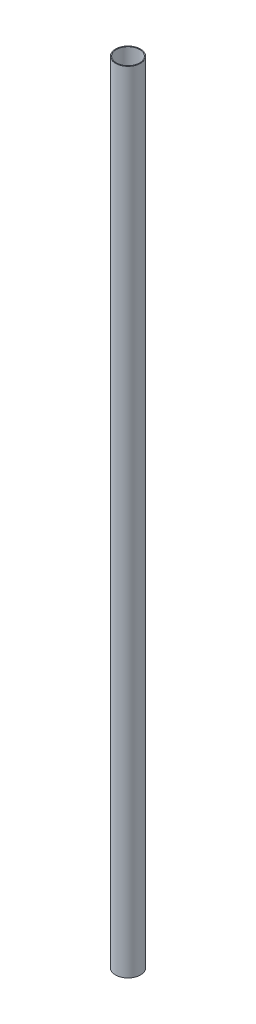
ISO-10303-21;
HEADER;
FILE_DESCRIPTION(('STEP AP214'),'2;1');
FILE_NAME('part.step','',(''),(''),'','','');
FILE_SCHEMA(('AUTOMOTIVE_DESIGN { 1 0 10303 214 1 1 1 1 }'));
ENDSEC;
DATA;
#1=APPLICATION_CONTEXT('core data for automotive mechanical design processes');
#2=APPLICATION_PROTOCOL_DEFINITION('international standard','automotive_design',2000,#1);
#3=PRODUCT_CONTEXT('',#1,'mechanical');
#4=PRODUCT('Part','Part','',(#3));
#5=PRODUCT_RELATED_PRODUCT_CATEGORY('part','',(#4));
#6=PRODUCT_DEFINITION_FORMATION('','',#4);
#7=PRODUCT_DEFINITION_CONTEXT('part definition',#1,'design');
#8=PRODUCT_DEFINITION('design','',#6,#7);
#9=PRODUCT_DEFINITION_SHAPE('','',#8);
#10=(LENGTH_UNIT() NAMED_UNIT(*) SI_UNIT(.MILLI.,.METRE.));
#11=(NAMED_UNIT(*) PLANE_ANGLE_UNIT() SI_UNIT($,.RADIAN.));
#12=(NAMED_UNIT(*) SI_UNIT($,.STERADIAN.) SOLID_ANGLE_UNIT());
#13=UNCERTAINTY_MEASURE_WITH_UNIT(LENGTH_MEASURE(1.E-05),#10,'distance_accuracy_value','');
#14=(GEOMETRIC_REPRESENTATION_CONTEXT(3) GLOBAL_UNCERTAINTY_ASSIGNED_CONTEXT((#13)) GLOBAL_UNIT_ASSIGNED_CONTEXT((#10,
#11,#12)) REPRESENTATION_CONTEXT('',''));
#15=CARTESIAN_POINT('',(0.,0.,0.));
#16=DIRECTION('',(0.,0.,1.));
#17=DIRECTION('',(1.,0.,0.));
#18=AXIS2_PLACEMENT_3D('',#15,#16,#17);
#19=CARTESIAN_POINT('',(0.,950.,0.));
#20=DIRECTION('',(0.,1.,0.));
#21=DIRECTION('',(0.,0.,1.));
#22=AXIS2_PLACEMENT_3D('',#19,#20,#21);
#23=PLANE('',#22);
#24=CARTESIAN_POINT('',(0.,950.,0.));
#25=DIRECTION('',(0.,1.,0.));
#26=DIRECTION('',(0.,0.,1.));
#27=AXIS2_PLACEMENT_3D('',#24,#25,#26);
#28=CIRCLE('',#27,15.);
#29=CARTESIAN_POINT('',(0.,950.,15.));
#30=VERTEX_POINT('',#29);
#31=EDGE_CURVE('E10',#30,#30,#28,.T.);
#32=ORIENTED_EDGE('',*,*,#31,.T.);
#33=EDGE_LOOP('',(#32));
#34=FACE_BOUND('',#33,.T.);
#35=CARTESIAN_POINT('',(0.,950.,0.));
#36=DIRECTION('',(0.,1.,0.));
#37=DIRECTION('',(0.,0.,1.));
#38=AXIS2_PLACEMENT_3D('',#35,#36,#37);
#39=CIRCLE('',#38,14.);
#40=CARTESIAN_POINT('',(0.,950.,14.));
#41=VERTEX_POINT('',#40);
#42=EDGE_CURVE('E41',#41,#41,#39,.T.);
#43=ORIENTED_EDGE('',*,*,#42,.F.);
#44=EDGE_LOOP('',(#43));
#45=FACE_BOUND('',#44,.T.);
#46=ADVANCED_FACE('F30',(#34,#45),#23,.T.);
#47=CARTESIAN_POINT('',(0.,0.,0.));
#48=DIRECTION('',(0.,1.,0.));
#49=DIRECTION('',(0.,0.,1.));
#50=AXIS2_PLACEMENT_3D('',#47,#48,#49);
#51=PLANE('',#50);
#52=CARTESIAN_POINT('',(0.,0.,0.));
#53=DIRECTION('',(0.,1.,0.));
#54=DIRECTION('',(0.,0.,1.));
#55=AXIS2_PLACEMENT_3D('',#52,#53,#54);
#56=CIRCLE('',#55,15.);
#57=CARTESIAN_POINT('',(0.,0.,15.));
#58=VERTEX_POINT('',#57);
#59=EDGE_CURVE('E34',#58,#58,#56,.T.);
#60=ORIENTED_EDGE('',*,*,#59,.F.);
#61=EDGE_LOOP('',(#60));
#62=FACE_BOUND('',#61,.T.);
#63=CARTESIAN_POINT('',(0.,0.,0.));
#64=DIRECTION('',(0.,1.,0.));
#65=DIRECTION('',(0.,0.,1.));
#66=AXIS2_PLACEMENT_3D('',#63,#64,#65);
#67=CIRCLE('',#66,14.);
#68=CARTESIAN_POINT('',(0.,0.,14.));
#69=VERTEX_POINT('',#68);
#70=EDGE_CURVE('E43',#69,#69,#67,.T.);
#71=ORIENTED_EDGE('',*,*,#70,.T.);
#72=EDGE_LOOP('',(#71));
#73=FACE_BOUND('',#72,.T.);
#74=ADVANCED_FACE('F53',(#62,#73),#51,.F.);
#75=CARTESIAN_POINT('',(0.,950.,0.));
#76=DIRECTION('',(0.,-1.,0.));
#77=DIRECTION('',(0.,0.,-1.));
#78=AXIS2_PLACEMENT_3D('',#75,#76,#77);
#79=CYLINDRICAL_SURFACE('',#78,15.);
#80=ORIENTED_EDGE('',*,*,#31,.F.);
#81=EDGE_LOOP('',(#80));
#82=FACE_BOUND('',#81,.T.);
#83=ORIENTED_EDGE('',*,*,#59,.T.);
#84=EDGE_LOOP('',(#83));
#85=FACE_BOUND('',#84,.T.);
#86=ADVANCED_FACE('F32',(#82,#85),#79,.T.);
#87=CARTESIAN_POINT('',(0.,950.,0.));
#88=DIRECTION('',(0.,-1.,0.));
#89=DIRECTION('',(0.,0.,-1.));
#90=AXIS2_PLACEMENT_3D('',#87,#88,#89);
#91=CYLINDRICAL_SURFACE('',#90,14.);
#92=ORIENTED_EDGE('',*,*,#42,.T.);
#93=EDGE_LOOP('',(#92));
#94=FACE_BOUND('',#93,.T.);
#95=ORIENTED_EDGE('',*,*,#70,.F.);
#96=EDGE_LOOP('',(#95));
#97=FACE_BOUND('',#96,.T.);
#98=ADVANCED_FACE('F49',(#94,#97),#91,.F.);
#99=CLOSED_SHELL('',(#46,#74,#86,#98));
#100=MANIFOLD_SOLID_BREP('B2',#99);
#101=ADVANCED_BREP_SHAPE_REPRESENTATION('',(#18,#100),#14);
#102=SHAPE_DEFINITION_REPRESENTATION(#9,#101);
ENDSEC;
END-ISO-10303-21;
